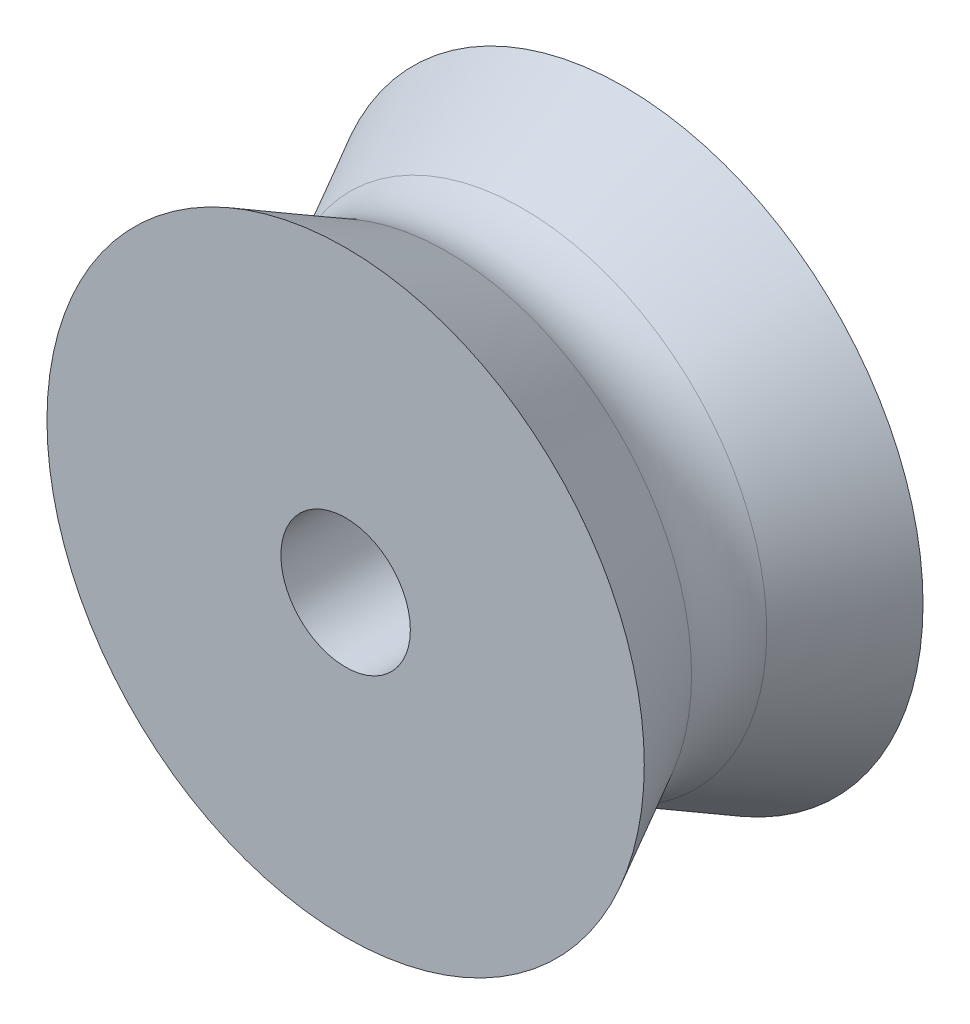
ISO-10303-21;
HEADER;
FILE_DESCRIPTION(('STEP AP214'),'2;1');
FILE_NAME('part.step','',(''),(''),'','','');
FILE_SCHEMA(('AUTOMOTIVE_DESIGN { 1 0 10303 214 1 1 1 1 }'));
ENDSEC;
DATA;
#1=APPLICATION_CONTEXT('core data for automotive mechanical design processes');
#2=APPLICATION_PROTOCOL_DEFINITION('international standard','automotive_design',2000,#1);
#3=PRODUCT_CONTEXT('',#1,'mechanical');
#4=PRODUCT('Part','Part','',(#3));
#5=PRODUCT_RELATED_PRODUCT_CATEGORY('part','',(#4));
#6=PRODUCT_DEFINITION_FORMATION('','',#4);
#7=PRODUCT_DEFINITION_CONTEXT('part definition',#1,'design');
#8=PRODUCT_DEFINITION('design','',#6,#7);
#9=PRODUCT_DEFINITION_SHAPE('','',#8);
#10=(LENGTH_UNIT() NAMED_UNIT(*) SI_UNIT(.MILLI.,.METRE.));
#11=(NAMED_UNIT(*) PLANE_ANGLE_UNIT() SI_UNIT($,.RADIAN.));
#12=(NAMED_UNIT(*) SI_UNIT($,.STERADIAN.) SOLID_ANGLE_UNIT());
#13=UNCERTAINTY_MEASURE_WITH_UNIT(LENGTH_MEASURE(1.E-05),#10,'distance_accuracy_value','');
#14=(GEOMETRIC_REPRESENTATION_CONTEXT(3) GLOBAL_UNCERTAINTY_ASSIGNED_CONTEXT((#13)) GLOBAL_UNIT_ASSIGNED_CONTEXT((#10,
#11,#12)) REPRESENTATION_CONTEXT('',''));
#15=CARTESIAN_POINT('',(0.,0.,0.));
#16=DIRECTION('',(0.,0.,1.));
#17=DIRECTION('',(1.,0.,0.));
#18=AXIS2_PLACEMENT_3D('',#15,#16,#17);
#19=CARTESIAN_POINT('',(15.,0.,0.));
#20=DIRECTION('',(0.,0.,1.));
#21=DIRECTION('',(1.,0.,0.));
#22=AXIS2_PLACEMENT_3D('',#19,#20,#21);
#23=PLANE('',#22);
#24=CARTESIAN_POINT('',(0.,0.,0.));
#25=DIRECTION('',(0.,0.,1.));
#26=DIRECTION('',(1.,0.,0.));
#27=AXIS2_PLACEMENT_3D('',#24,#25,#26);
#28=CIRCLE('',#27,15.);
#29=CARTESIAN_POINT('',(15.,0.,0.));
#30=VERTEX_POINT('',#29);
#31=EDGE_CURVE('E10',#30,#30,#28,.T.);
#32=ORIENTED_EDGE('',*,*,#31,.T.);
#33=EDGE_LOOP('',(#32));
#34=FACE_BOUND('',#33,.T.);
#35=CARTESIAN_POINT('',(0.,0.,0.));
#36=DIRECTION('',(0.,0.,1.));
#37=DIRECTION('',(1.,0.,0.));
#38=AXIS2_PLACEMENT_3D('',#35,#36,#37);
#39=CIRCLE('',#38,3.25);
#40=CARTESIAN_POINT('',(3.25,0.,0.));
#41=VERTEX_POINT('',#40);
#42=EDGE_CURVE('E55',#41,#41,#39,.T.);
#43=ORIENTED_EDGE('',*,*,#42,.F.);
#44=EDGE_LOOP('',(#43));
#45=FACE_BOUND('',#44,.T.);
#46=ADVANCED_FACE('F33',(#34,#45),#23,.T.);
#47=CARTESIAN_POINT('',(0.,0.,0.));
#48=DIRECTION('',(0.,0.,1.));
#49=DIRECTION('',(1.,0.,0.));
#50=AXIS2_PLACEMENT_3D('',#47,#48,#49);
#51=CONICAL_SURFACE('',#50,15.,0.491809175988699);
#52=CARTESIAN_POINT('',(0.,0.,-5.11111434993831));
#53=DIRECTION('',(0.,0.,1.));
#54=DIRECTION('',(1.,0.,0.));
#55=AXIS2_PLACEMENT_3D('',#52,#53,#54);
#56=CIRCLE('',#55,12.2619030268188);
#57=CARTESIAN_POINT('',(12.2619030268188,0.,-5.11111434993831));
#58=VERTEX_POINT('',#57);
#59=EDGE_CURVE('E39',#58,#58,#56,.T.);
#60=ORIENTED_EDGE('',*,*,#59,.T.);
#61=EDGE_LOOP('',(#60));
#62=FACE_BOUND('',#61,.T.);
#63=ORIENTED_EDGE('',*,*,#31,.F.);
#64=EDGE_LOOP('',(#63));
#65=FACE_BOUND('',#64,.T.);
#66=ADVANCED_FACE('F63',(#62,#65),#51,.T.);
#67=CARTESIAN_POINT('',(0.,0.,-7.));
#68=DIRECTION('',(0.,0.,1.));
#69=DIRECTION('',(1.,0.,0.));
#70=AXIS2_PLACEMENT_3D('',#67,#68,#69);
#71=TOROIDAL_SURFACE('',#70,15.7878229069339,4.);
#72=CARTESIAN_POINT('',(0.,0.,-8.88888565006169));
#73=DIRECTION('',(0.,0.,1.));
#74=DIRECTION('',(1.,0.,0.));
#75=AXIS2_PLACEMENT_3D('',#72,#73,#74);
#76=CIRCLE('',#75,12.2619030268188);
#77=CARTESIAN_POINT('',(12.2619030268188,0.,-8.88888565006169));
#78=VERTEX_POINT('',#77);
#79=EDGE_CURVE('E43',#78,#78,#76,.T.);
#80=ORIENTED_EDGE('',*,*,#79,.T.);
#81=EDGE_LOOP('',(#80));
#82=FACE_BOUND('',#81,.T.);
#83=ORIENTED_EDGE('',*,*,#59,.F.);
#84=EDGE_LOOP('',(#83));
#85=FACE_BOUND('',#84,.T.);
#86=ADVANCED_FACE('F67',(#82,#85),#71,.F.);
#87=CARTESIAN_POINT('',(0.,0.,-8.88888565006169));
#88=DIRECTION('',(0.,0.,-1.));
#89=DIRECTION('',(-1.,0.,0.));
#90=AXIS2_PLACEMENT_3D('',#87,#88,#89);
#91=CONICAL_SURFACE('',#90,12.2619030268188,0.491809175988699);
#92=CARTESIAN_POINT('',(0.,0.,-14.));
#93=DIRECTION('',(0.,0.,1.));
#94=DIRECTION('',(1.,0.,0.));
#95=AXIS2_PLACEMENT_3D('',#92,#93,#94);
#96=CIRCLE('',#95,15.);
#97=CARTESIAN_POINT('',(15.,0.,-14.));
#98=VERTEX_POINT('',#97);
#99=EDGE_CURVE('E47',#98,#98,#96,.T.);
#100=ORIENTED_EDGE('',*,*,#99,.T.);
#101=EDGE_LOOP('',(#100));
#102=FACE_BOUND('',#101,.T.);
#103=ORIENTED_EDGE('',*,*,#79,.F.);
#104=EDGE_LOOP('',(#103));
#105=FACE_BOUND('',#104,.T.);
#106=ADVANCED_FACE('F71',(#102,#105),#91,.T.);
#107=CARTESIAN_POINT('',(3.25,0.,-14.));
#108=DIRECTION('',(0.,0.,-1.));
#109=DIRECTION('',(-1.,0.,0.));
#110=AXIS2_PLACEMENT_3D('',#107,#108,#109);
#111=PLANE('',#110);
#112=CARTESIAN_POINT('',(0.,0.,-14.));
#113=DIRECTION('',(0.,0.,1.));
#114=DIRECTION('',(1.,0.,0.));
#115=AXIS2_PLACEMENT_3D('',#112,#113,#114);
#116=CIRCLE('',#115,3.25);
#117=CARTESIAN_POINT('',(3.25,0.,-14.));
#118=VERTEX_POINT('',#117);
#119=EDGE_CURVE('E52',#118,#118,#116,.T.);
#120=ORIENTED_EDGE('',*,*,#119,.T.);
#121=EDGE_LOOP('',(#120));
#122=FACE_BOUND('',#121,.T.);
#123=ORIENTED_EDGE('',*,*,#99,.F.);
#124=EDGE_LOOP('',(#123));
#125=FACE_BOUND('',#124,.T.);
#126=ADVANCED_FACE('F78',(#122,#125),#111,.T.);
#127=CARTESIAN_POINT('',(0.,0.,0.));
#128=DIRECTION('',(0.,0.,1.));
#129=DIRECTION('',(1.,0.,0.));
#130=AXIS2_PLACEMENT_3D('',#127,#128,#129);
#131=CYLINDRICAL_SURFACE('',#130,3.25);
#132=ORIENTED_EDGE('',*,*,#42,.T.);
#133=EDGE_LOOP('',(#132));
#134=FACE_BOUND('',#133,.T.);
#135=ORIENTED_EDGE('',*,*,#119,.F.);
#136=EDGE_LOOP('',(#135));
#137=FACE_BOUND('',#136,.T.);
#138=ADVANCED_FACE('F59',(#134,#137),#131,.F.);
#139=CLOSED_SHELL('',(#46,#66,#86,#106,#126,#138));
#140=MANIFOLD_SOLID_BREP('B2',#139);
#141=ADVANCED_BREP_SHAPE_REPRESENTATION('',(#18,#140),#14);
#142=SHAPE_DEFINITION_REPRESENTATION(#9,#141);
ENDSEC;
END-ISO-10303-21;
